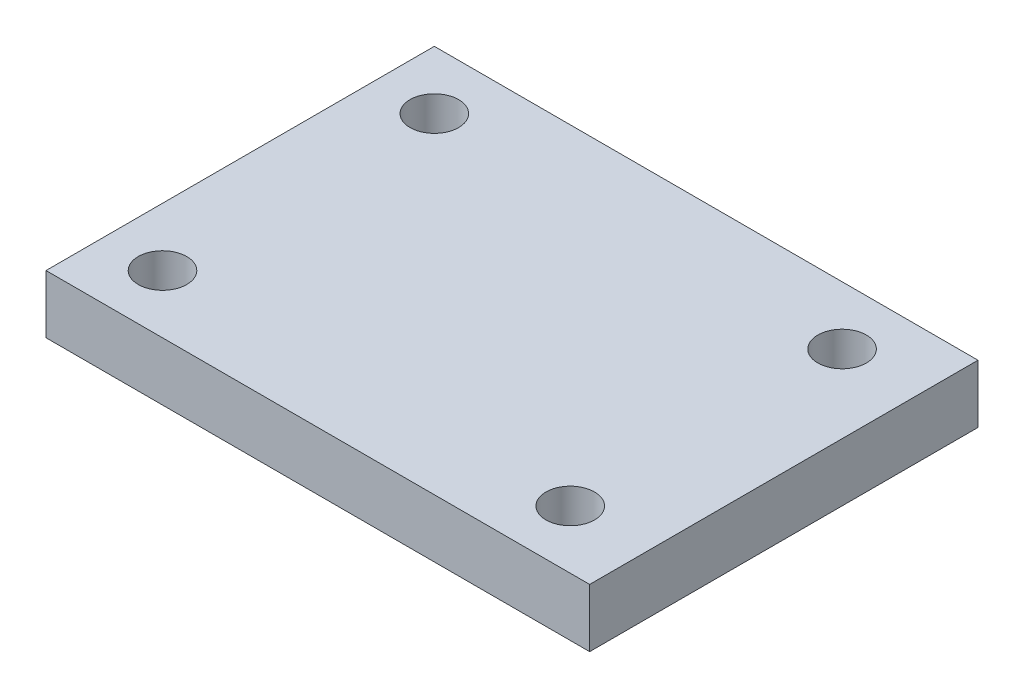
ISO-10303-21;
HEADER;
FILE_DESCRIPTION(('STEP AP214'),'2;1');
FILE_NAME('part.step','',(''),(''),'','','');
FILE_SCHEMA(('AUTOMOTIVE_DESIGN { 1 0 10303 214 1 1 1 1 }'));
ENDSEC;
DATA;
#1=APPLICATION_CONTEXT('core data for automotive mechanical design processes');
#2=APPLICATION_PROTOCOL_DEFINITION('international standard','automotive_design',2000,#1);
#3=PRODUCT_CONTEXT('',#1,'mechanical');
#4=PRODUCT('Part','Part','',(#3));
#5=PRODUCT_RELATED_PRODUCT_CATEGORY('part','',(#4));
#6=PRODUCT_DEFINITION_FORMATION('','',#4);
#7=PRODUCT_DEFINITION_CONTEXT('part definition',#1,'design');
#8=PRODUCT_DEFINITION('design','',#6,#7);
#9=PRODUCT_DEFINITION_SHAPE('','',#8);
#10=(LENGTH_UNIT() NAMED_UNIT(*) SI_UNIT(.MILLI.,.METRE.));
#11=(NAMED_UNIT(*) PLANE_ANGLE_UNIT() SI_UNIT($,.RADIAN.));
#12=(NAMED_UNIT(*) SI_UNIT($,.STERADIAN.) SOLID_ANGLE_UNIT());
#13=UNCERTAINTY_MEASURE_WITH_UNIT(LENGTH_MEASURE(1.E-05),#10,'distance_accuracy_value','');
#14=(GEOMETRIC_REPRESENTATION_CONTEXT(3) GLOBAL_UNCERTAINTY_ASSIGNED_CONTEXT((#13)) GLOBAL_UNIT_ASSIGNED_CONTEXT((#10,
#11,#12)) REPRESENTATION_CONTEXT('',''));
#15=CARTESIAN_POINT('',(0.,0.,0.));
#16=DIRECTION('',(0.,0.,1.));
#17=DIRECTION('',(1.,0.,0.));
#18=AXIS2_PLACEMENT_3D('',#15,#16,#17);
#19=CARTESIAN_POINT('',(0.,3.,0.));
#20=DIRECTION('',(1.,0.,0.));
#21=DIRECTION('',(0.,0.,-1.));
#22=AXIS2_PLACEMENT_3D('',#19,#20,#21);
#23=PLANE('',#22);
#24=DIRECTION('',(0.,0.,1.));
#25=VECTOR('',#24,1.);
#26=CARTESIAN_POINT('',(0.,0.,0.));
#27=LINE('',#26,#25);
#28=CARTESIAN_POINT('',(0.,0.,-20.));
#29=VERTEX_POINT('',#28);
#30=CARTESIAN_POINT('',(0.,0.,0.));
#31=VERTEX_POINT('',#30);
#32=EDGE_CURVE('E106',#29,#31,#27,.T.);
#33=ORIENTED_EDGE('',*,*,#32,.T.);
#34=DIRECTION('',(0.,-1.,0.));
#35=VECTOR('',#34,1.);
#36=CARTESIAN_POINT('',(0.,3.,0.));
#37=LINE('',#36,#35);
#38=CARTESIAN_POINT('',(0.,3.,0.));
#39=VERTEX_POINT('',#38);
#40=EDGE_CURVE('E11',#39,#31,#37,.T.);
#41=ORIENTED_EDGE('',*,*,#40,.F.);
#42=DIRECTION('',(0.,0.,1.));
#43=VECTOR('',#42,1.);
#44=CARTESIAN_POINT('',(0.,3.,0.));
#45=LINE('',#44,#43);
#46=CARTESIAN_POINT('',(0.,3.,-20.));
#47=VERTEX_POINT('',#46);
#48=EDGE_CURVE('E94',#47,#39,#45,.T.);
#49=ORIENTED_EDGE('',*,*,#48,.F.);
#50=DIRECTION('',(0.,-1.,0.));
#51=VECTOR('',#50,1.);
#52=CARTESIAN_POINT('',(0.,3.,-20.));
#53=LINE('',#52,#51);
#54=EDGE_CURVE('E102',#47,#29,#53,.T.);
#55=ORIENTED_EDGE('',*,*,#54,.T.);
#56=EDGE_LOOP('',(#33,#41,#49,#55));
#57=FACE_BOUND('',#56,.T.);
#58=ADVANCED_FACE('F43',(#57),#23,.F.);
#59=CARTESIAN_POINT('',(0.,3.,0.));
#60=DIRECTION('',(0.,0.,-1.));
#61=DIRECTION('',(-1.,0.,0.));
#62=AXIS2_PLACEMENT_3D('',#59,#60,#61);
#63=PLANE('',#62);
#64=DIRECTION('',(1.,0.,0.));
#65=VECTOR('',#64,1.);
#66=CARTESIAN_POINT('',(0.,0.,0.));
#67=LINE('',#66,#65);
#68=CARTESIAN_POINT('',(28.,0.,0.));
#69=VERTEX_POINT('',#68);
#70=EDGE_CURVE('E98',#31,#69,#67,.T.);
#71=ORIENTED_EDGE('',*,*,#70,.T.);
#72=DIRECTION('',(0.,-1.,0.));
#73=VECTOR('',#72,1.);
#74=CARTESIAN_POINT('',(28.,3.,0.));
#75=LINE('',#74,#73);
#76=CARTESIAN_POINT('',(28.,3.,0.));
#77=VERTEX_POINT('',#76);
#78=EDGE_CURVE('E51',#77,#69,#75,.T.);
#79=ORIENTED_EDGE('',*,*,#78,.F.);
#80=DIRECTION('',(1.,0.,0.));
#81=VECTOR('',#80,1.);
#82=CARTESIAN_POINT('',(0.,3.,0.));
#83=LINE('',#82,#81);
#84=EDGE_CURVE('E89',#39,#77,#83,.T.);
#85=ORIENTED_EDGE('',*,*,#84,.F.);
#86=ORIENTED_EDGE('',*,*,#40,.T.);
#87=EDGE_LOOP('',(#71,#79,#85,#86));
#88=FACE_BOUND('',#87,.T.);
#89=ADVANCED_FACE('F97',(#88),#63,.F.);
#90=CARTESIAN_POINT('',(28.,3.,0.));
#91=DIRECTION('',(-1.,0.,0.));
#92=DIRECTION('',(0.,0.,1.));
#93=AXIS2_PLACEMENT_3D('',#90,#91,#92);
#94=PLANE('',#93);
#95=DIRECTION('',(0.,0.,-1.));
#96=VECTOR('',#95,1.);
#97=CARTESIAN_POINT('',(28.,0.,0.));
#98=LINE('',#97,#96);
#99=CARTESIAN_POINT('',(28.,0.,-20.));
#100=VERTEX_POINT('',#99);
#101=EDGE_CURVE('E76',#69,#100,#98,.T.);
#102=ORIENTED_EDGE('',*,*,#101,.T.);
#103=DIRECTION('',(0.,-1.,0.));
#104=VECTOR('',#103,1.);
#105=CARTESIAN_POINT('',(28.,3.,-20.));
#106=LINE('',#105,#104);
#107=CARTESIAN_POINT('',(28.,3.,-20.));
#108=VERTEX_POINT('',#107);
#109=EDGE_CURVE('E99',#108,#100,#106,.T.);
#110=ORIENTED_EDGE('',*,*,#109,.F.);
#111=DIRECTION('',(0.,0.,-1.));
#112=VECTOR('',#111,1.);
#113=CARTESIAN_POINT('',(28.,3.,0.));
#114=LINE('',#113,#112);
#115=EDGE_CURVE('E92',#77,#108,#114,.T.);
#116=ORIENTED_EDGE('',*,*,#115,.F.);
#117=ORIENTED_EDGE('',*,*,#78,.T.);
#118=EDGE_LOOP('',(#102,#110,#116,#117));
#119=FACE_BOUND('',#118,.T.);
#120=ADVANCED_FACE('F100',(#119),#94,.F.);
#121=CARTESIAN_POINT('',(0.,3.,-20.));
#122=DIRECTION('',(0.,0.,1.));
#123=DIRECTION('',(1.,0.,0.));
#124=AXIS2_PLACEMENT_3D('',#121,#122,#123);
#125=PLANE('',#124);
#126=DIRECTION('',(-1.,0.,0.));
#127=VECTOR('',#126,1.);
#128=CARTESIAN_POINT('',(0.,0.,-20.));
#129=LINE('',#128,#127);
#130=EDGE_CURVE('E82',#100,#29,#129,.T.);
#131=ORIENTED_EDGE('',*,*,#130,.T.);
#132=ORIENTED_EDGE('',*,*,#54,.F.);
#133=DIRECTION('',(-1.,0.,0.));
#134=VECTOR('',#133,1.);
#135=CARTESIAN_POINT('',(0.,3.,-20.));
#136=LINE('',#135,#134);
#137=EDGE_CURVE('E59',#108,#47,#136,.T.);
#138=ORIENTED_EDGE('',*,*,#137,.F.);
#139=ORIENTED_EDGE('',*,*,#109,.T.);
#140=EDGE_LOOP('',(#131,#132,#138,#139));
#141=FACE_BOUND('',#140,.T.);
#142=ADVANCED_FACE('F114',(#141),#125,.F.);
#143=CARTESIAN_POINT('',(0.,3.,0.));
#144=DIRECTION('',(0.,-1.,0.));
#145=DIRECTION('',(0.,0.,-1.));
#146=AXIS2_PLACEMENT_3D('',#143,#144,#145);
#147=PLANE('',#146);
#148=CARTESIAN_POINT('',(3.,3.,-17.));
#149=DIRECTION('',(0.,1.,0.));
#150=DIRECTION('',(0.,0.,1.));
#151=AXIS2_PLACEMENT_3D('',#148,#149,#150);
#152=CIRCLE('',#151,1.25);
#153=CARTESIAN_POINT('',(3.,3.,-15.75));
#154=VERTEX_POINT('',#153);
#155=EDGE_CURVE('E140',#154,#154,#152,.T.);
#156=ORIENTED_EDGE('',*,*,#155,.F.);
#157=EDGE_LOOP('',(#156));
#158=FACE_BOUND('',#157,.T.);
#159=CARTESIAN_POINT('',(3.,3.,-3.));
#160=DIRECTION('',(0.,1.,0.));
#161=DIRECTION('',(0.,0.,1.));
#162=AXIS2_PLACEMENT_3D('',#159,#160,#161);
#163=CIRCLE('',#162,1.25);
#164=CARTESIAN_POINT('',(3.,3.,-1.75));
#165=VERTEX_POINT('',#164);
#166=EDGE_CURVE('E134',#165,#165,#163,.T.);
#167=ORIENTED_EDGE('',*,*,#166,.F.);
#168=EDGE_LOOP('',(#167));
#169=FACE_BOUND('',#168,.T.);
#170=CARTESIAN_POINT('',(24.,3.,-3.));
#171=DIRECTION('',(0.,1.,0.));
#172=DIRECTION('',(0.,0.,1.));
#173=AXIS2_PLACEMENT_3D('',#170,#171,#172);
#174=CIRCLE('',#173,1.25);
#175=CARTESIAN_POINT('',(24.,3.,-1.75));
#176=VERTEX_POINT('',#175);
#177=EDGE_CURVE('E128',#176,#176,#174,.T.);
#178=ORIENTED_EDGE('',*,*,#177,.F.);
#179=EDGE_LOOP('',(#178));
#180=FACE_BOUND('',#179,.T.);
#181=CARTESIAN_POINT('',(24.,3.,-17.));
#182=DIRECTION('',(0.,1.,0.));
#183=DIRECTION('',(0.,0.,1.));
#184=AXIS2_PLACEMENT_3D('',#181,#182,#183);
#185=CIRCLE('',#184,1.25);
#186=CARTESIAN_POINT('',(24.,3.,-15.75));
#187=VERTEX_POINT('',#186);
#188=EDGE_CURVE('E122',#187,#187,#185,.T.);
#189=ORIENTED_EDGE('',*,*,#188,.F.);
#190=EDGE_LOOP('',(#189));
#191=FACE_BOUND('',#190,.T.);
#192=ORIENTED_EDGE('',*,*,#48,.T.);
#193=ORIENTED_EDGE('',*,*,#84,.T.);
#194=ORIENTED_EDGE('',*,*,#115,.T.);
#195=ORIENTED_EDGE('',*,*,#137,.T.);
#196=EDGE_LOOP('',(#192,#193,#194,#195));
#197=FACE_BOUND('',#196,.T.);
#198=ADVANCED_FACE('F90',(#158,#169,#180,#191,#197),#147,.F.);
#199=CARTESIAN_POINT('',(0.,0.,0.));
#200=DIRECTION('',(0.,-1.,0.));
#201=DIRECTION('',(0.,0.,-1.));
#202=AXIS2_PLACEMENT_3D('',#199,#200,#201);
#203=PLANE('',#202);
#204=CARTESIAN_POINT('',(3.,0.,-17.));
#205=DIRECTION('',(0.,1.,0.));
#206=DIRECTION('',(0.,0.,1.));
#207=AXIS2_PLACEMENT_3D('',#204,#205,#206);
#208=CIRCLE('',#207,1.25);
#209=CARTESIAN_POINT('',(3.,0.,-15.75));
#210=VERTEX_POINT('',#209);
#211=EDGE_CURVE('E137',#210,#210,#208,.T.);
#212=ORIENTED_EDGE('',*,*,#211,.T.);
#213=EDGE_LOOP('',(#212));
#214=FACE_BOUND('',#213,.T.);
#215=CARTESIAN_POINT('',(3.,0.,-3.));
#216=DIRECTION('',(0.,1.,0.));
#217=DIRECTION('',(0.,0.,1.));
#218=AXIS2_PLACEMENT_3D('',#215,#216,#217);
#219=CIRCLE('',#218,1.25);
#220=CARTESIAN_POINT('',(3.,0.,-1.75));
#221=VERTEX_POINT('',#220);
#222=EDGE_CURVE('E131',#221,#221,#219,.T.);
#223=ORIENTED_EDGE('',*,*,#222,.T.);
#224=EDGE_LOOP('',(#223));
#225=FACE_BOUND('',#224,.T.);
#226=CARTESIAN_POINT('',(24.,0.,-3.));
#227=DIRECTION('',(0.,1.,0.));
#228=DIRECTION('',(0.,0.,1.));
#229=AXIS2_PLACEMENT_3D('',#226,#227,#228);
#230=CIRCLE('',#229,1.25);
#231=CARTESIAN_POINT('',(24.,0.,-1.75));
#232=VERTEX_POINT('',#231);
#233=EDGE_CURVE('E125',#232,#232,#230,.T.);
#234=ORIENTED_EDGE('',*,*,#233,.T.);
#235=EDGE_LOOP('',(#234));
#236=FACE_BOUND('',#235,.T.);
#237=CARTESIAN_POINT('',(24.,0.,-17.));
#238=DIRECTION('',(0.,1.,0.));
#239=DIRECTION('',(0.,0.,1.));
#240=AXIS2_PLACEMENT_3D('',#237,#238,#239);
#241=CIRCLE('',#240,1.25);
#242=CARTESIAN_POINT('',(24.,0.,-15.75));
#243=VERTEX_POINT('',#242);
#244=EDGE_CURVE('E109',#243,#243,#241,.T.);
#245=ORIENTED_EDGE('',*,*,#244,.T.);
#246=EDGE_LOOP('',(#245));
#247=FACE_BOUND('',#246,.T.);
#248=ORIENTED_EDGE('',*,*,#32,.F.);
#249=ORIENTED_EDGE('',*,*,#130,.F.);
#250=ORIENTED_EDGE('',*,*,#101,.F.);
#251=ORIENTED_EDGE('',*,*,#70,.F.);
#252=EDGE_LOOP('',(#248,#249,#250,#251));
#253=FACE_BOUND('',#252,.T.);
#254=ADVANCED_FACE('F117',(#214,#225,#236,#247,#253),#203,.T.);
#255=CARTESIAN_POINT('',(24.,3.,-17.));
#256=DIRECTION('',(0.,1.,0.));
#257=DIRECTION('',(0.,0.,1.));
#258=AXIS2_PLACEMENT_3D('',#255,#256,#257);
#259=CYLINDRICAL_SURFACE('',#258,1.25);
#260=ORIENTED_EDGE('',*,*,#244,.F.);
#261=EDGE_LOOP('',(#260));
#262=FACE_BOUND('',#261,.T.);
#263=ORIENTED_EDGE('',*,*,#188,.T.);
#264=EDGE_LOOP('',(#263));
#265=FACE_BOUND('',#264,.T.);
#266=ADVANCED_FACE('F155',(#262,#265),#259,.F.);
#267=CARTESIAN_POINT('',(24.,3.,-3.));
#268=DIRECTION('',(0.,1.,0.));
#269=DIRECTION('',(0.,0.,1.));
#270=AXIS2_PLACEMENT_3D('',#267,#268,#269);
#271=CYLINDRICAL_SURFACE('',#270,1.25);
#272=ORIENTED_EDGE('',*,*,#233,.F.);
#273=EDGE_LOOP('',(#272));
#274=FACE_BOUND('',#273,.T.);
#275=ORIENTED_EDGE('',*,*,#177,.T.);
#276=EDGE_LOOP('',(#275));
#277=FACE_BOUND('',#276,.T.);
#278=ADVANCED_FACE('F157',(#274,#277),#271,.F.);
#279=CARTESIAN_POINT('',(3.,3.,-3.));
#280=DIRECTION('',(0.,1.,0.));
#281=DIRECTION('',(0.,0.,1.));
#282=AXIS2_PLACEMENT_3D('',#279,#280,#281);
#283=CYLINDRICAL_SURFACE('',#282,1.25);
#284=ORIENTED_EDGE('',*,*,#222,.F.);
#285=EDGE_LOOP('',(#284));
#286=FACE_BOUND('',#285,.T.);
#287=ORIENTED_EDGE('',*,*,#166,.T.);
#288=EDGE_LOOP('',(#287));
#289=FACE_BOUND('',#288,.T.);
#290=ADVANCED_FACE('F164',(#286,#289),#283,.F.);
#291=CARTESIAN_POINT('',(3.,3.,-17.));
#292=DIRECTION('',(0.,1.,0.));
#293=DIRECTION('',(0.,0.,1.));
#294=AXIS2_PLACEMENT_3D('',#291,#292,#293);
#295=CYLINDRICAL_SURFACE('',#294,1.25);
#296=ORIENTED_EDGE('',*,*,#211,.F.);
#297=EDGE_LOOP('',(#296));
#298=FACE_BOUND('',#297,.T.);
#299=ORIENTED_EDGE('',*,*,#155,.T.);
#300=EDGE_LOOP('',(#299));
#301=FACE_BOUND('',#300,.T.);
#302=ADVANCED_FACE('F144',(#298,#301),#295,.F.);
#303=CLOSED_SHELL('',(#58,#89,#120,#142,#198,#254,#266,#278,#290,#302));
#304=MANIFOLD_SOLID_BREP('B2',#303);
#305=ADVANCED_BREP_SHAPE_REPRESENTATION('',(#18,#304),#14);
#306=SHAPE_DEFINITION_REPRESENTATION(#9,#305);
ENDSEC;
END-ISO-10303-21;
